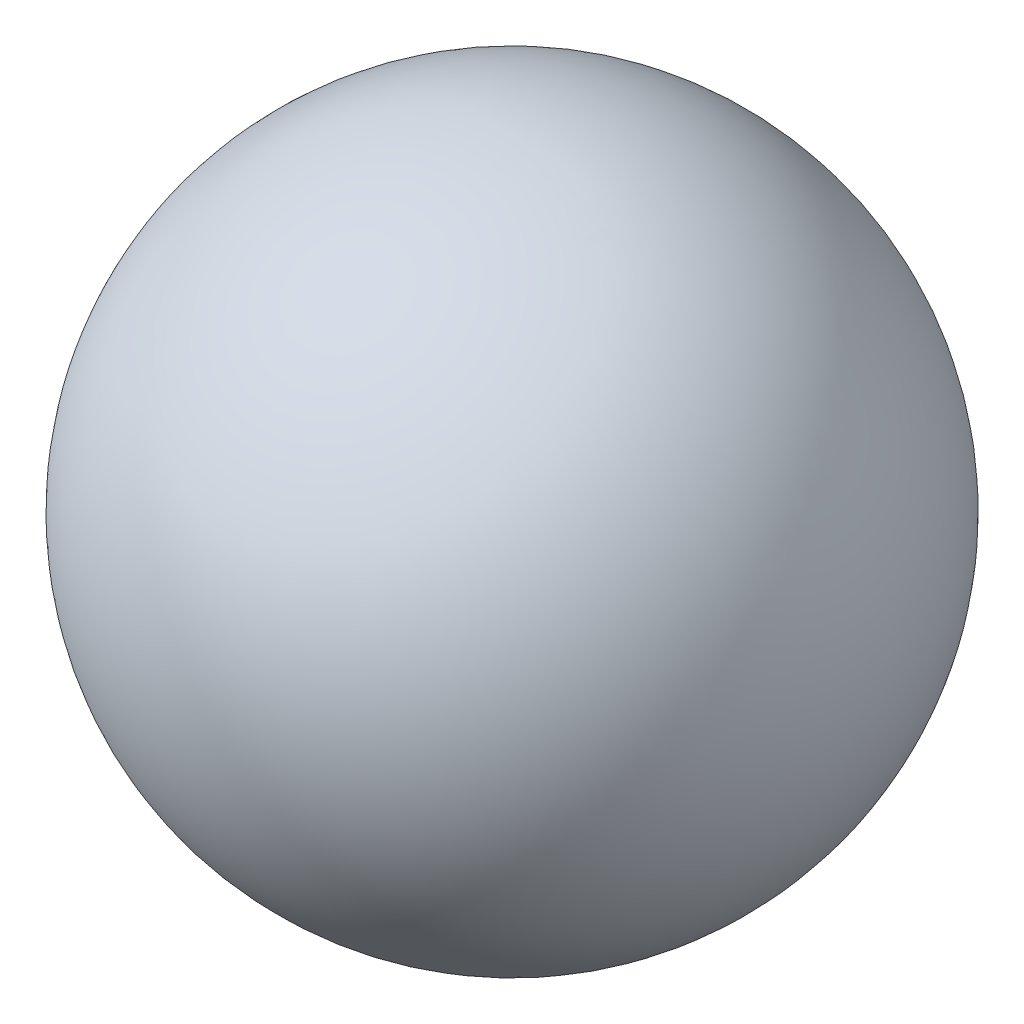
ISO-10303-21;
HEADER;
FILE_DESCRIPTION(('STEP AP214'),'2;1');
FILE_NAME('part.step','',(''),(''),'','','');
FILE_SCHEMA(('AUTOMOTIVE_DESIGN { 1 0 10303 214 1 1 1 1 }'));
ENDSEC;
DATA;
#1=APPLICATION_CONTEXT('core data for automotive mechanical design processes');
#2=APPLICATION_PROTOCOL_DEFINITION('international standard','automotive_design',2000,#1);
#3=PRODUCT_CONTEXT('',#1,'mechanical');
#4=PRODUCT('Part','Part','',(#3));
#5=PRODUCT_RELATED_PRODUCT_CATEGORY('part','',(#4));
#6=PRODUCT_DEFINITION_FORMATION('','',#4);
#7=PRODUCT_DEFINITION_CONTEXT('part definition',#1,'design');
#8=PRODUCT_DEFINITION('design','',#6,#7);
#9=PRODUCT_DEFINITION_SHAPE('','',#8);
#10=(LENGTH_UNIT() NAMED_UNIT(*) SI_UNIT(.MILLI.,.METRE.));
#11=(NAMED_UNIT(*) PLANE_ANGLE_UNIT() SI_UNIT($,.RADIAN.));
#12=(NAMED_UNIT(*) SI_UNIT($,.STERADIAN.) SOLID_ANGLE_UNIT());
#13=UNCERTAINTY_MEASURE_WITH_UNIT(LENGTH_MEASURE(1.E-05),#10,'distance_accuracy_value','');
#14=(GEOMETRIC_REPRESENTATION_CONTEXT(3) GLOBAL_UNCERTAINTY_ASSIGNED_CONTEXT((#13)) GLOBAL_UNIT_ASSIGNED_CONTEXT((#10,
#11,#12)) REPRESENTATION_CONTEXT('',''));
#15=CARTESIAN_POINT('',(0.,0.,0.));
#16=DIRECTION('',(0.,0.,1.));
#17=DIRECTION('',(1.,0.,0.));
#18=AXIS2_PLACEMENT_3D('',#15,#16,#17);
#19=CARTESIAN_POINT('',(0.,-10.31875,0.));
#20=DIRECTION('',(1.,0.,0.));
#21=DIRECTION('',(0.,1.,0.));
#22=AXIS2_PLACEMENT_3D('',#19,#20,#21);
#23=SPHERICAL_SURFACE('',#22,1.71627890103155);
#24=CARTESIAN_POINT('',(1.71627890103148,-10.31875,0.));
#25=VERTEX_POINT('',#24);
#26=VERTEX_LOOP('',#25);
#27=FACE_BOUND('',#26,.T.);
#28=CARTESIAN_POINT('',(-1.71627890103162,-10.31875,0.));
#29=VERTEX_POINT('',#28);
#30=VERTEX_LOOP('',#29);
#31=FACE_BOUND('',#30,.T.);
#32=ADVANCED_FACE('F16',(#27,#31),#23,.T.);
#33=CLOSED_SHELL('',(#32));
#34=MANIFOLD_SOLID_BREP('B1',#33);
#35=ADVANCED_BREP_SHAPE_REPRESENTATION('',(#18,#34),#14);
#36=SHAPE_DEFINITION_REPRESENTATION(#9,#35);
ENDSEC;
END-ISO-10303-21;
